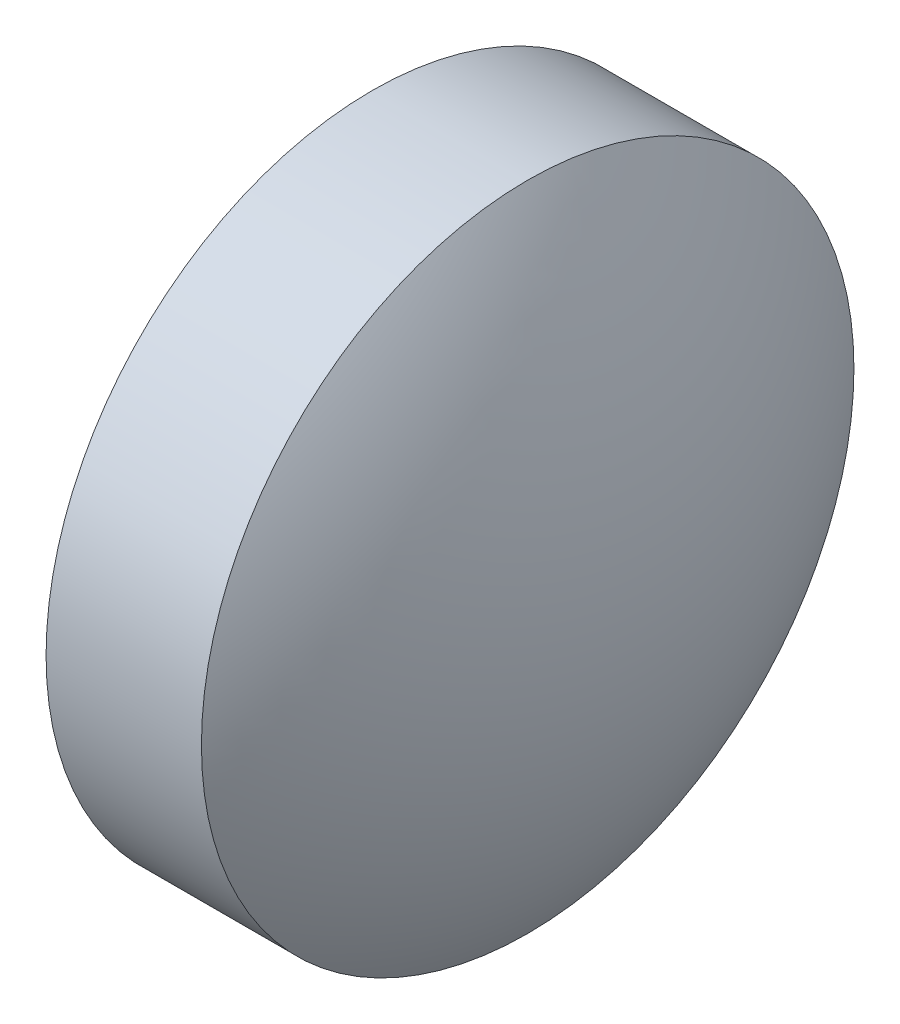
ISO-10303-21;
HEADER;
FILE_DESCRIPTION(('STEP AP214'),'2;1');
FILE_NAME('part.step','',(''),(''),'','','');
FILE_SCHEMA(('AUTOMOTIVE_DESIGN { 1 0 10303 214 1 1 1 1 }'));
ENDSEC;
DATA;
#1=APPLICATION_CONTEXT('core data for automotive mechanical design processes');
#2=APPLICATION_PROTOCOL_DEFINITION('international standard','automotive_design',2000,#1);
#3=PRODUCT_CONTEXT('',#1,'mechanical');
#4=PRODUCT('Part','Part','',(#3));
#5=PRODUCT_RELATED_PRODUCT_CATEGORY('part','',(#4));
#6=PRODUCT_DEFINITION_FORMATION('','',#4);
#7=PRODUCT_DEFINITION_CONTEXT('part definition',#1,'design');
#8=PRODUCT_DEFINITION('design','',#6,#7);
#9=PRODUCT_DEFINITION_SHAPE('','',#8);
#10=(LENGTH_UNIT() NAMED_UNIT(*) SI_UNIT(.MILLI.,.METRE.));
#11=(NAMED_UNIT(*) PLANE_ANGLE_UNIT() SI_UNIT($,.RADIAN.));
#12=(NAMED_UNIT(*) SI_UNIT($,.STERADIAN.) SOLID_ANGLE_UNIT());
#13=UNCERTAINTY_MEASURE_WITH_UNIT(LENGTH_MEASURE(1.E-05),#10,'distance_accuracy_value','');
#14=(GEOMETRIC_REPRESENTATION_CONTEXT(3) GLOBAL_UNCERTAINTY_ASSIGNED_CONTEXT((#13)) GLOBAL_UNIT_ASSIGNED_CONTEXT((#10,
#11,#12)) REPRESENTATION_CONTEXT('',''));
#15=CARTESIAN_POINT('',(0.,0.,0.));
#16=DIRECTION('',(0.,0.,1.));
#17=DIRECTION('',(1.,0.,0.));
#18=AXIS2_PLACEMENT_3D('',#15,#16,#17);
#19=CARTESIAN_POINT('',(414.701911471645,-21.677401606524,0.));
#20=DIRECTION('',(-1.,0.,0.));
#21=DIRECTION('',(0.,1.,0.));
#22=AXIS2_PLACEMENT_3D('',#19,#20,#21);
#23=SPHERICAL_SURFACE('',#22,5.74792553191489);
#24=CARTESIAN_POINT('',(419.50983700356,-21.677401606524,0.));
#25=DIRECTION('',(-1.,0.,0.));
#26=DIRECTION('',(0.,0.,1.));
#27=AXIS2_PLACEMENT_3D('',#24,#25,#26);
#28=CIRCLE('',#27,3.15);
#29=CARTESIAN_POINT('',(419.50983700356,-21.677401606524,3.15));
#30=VERTEX_POINT('',#29);
#31=EDGE_CURVE('E10',#30,#30,#28,.T.);
#32=ORIENTED_EDGE('',*,*,#31,.F.);
#33=EDGE_LOOP('',(#32));
#34=FACE_BOUND('',#33,.T.);
#35=ADVANCED_FACE('F35',(#34),#23,.T.);
#36=CARTESIAN_POINT('',(417.149198914811,-21.677401606524,0.));
#37=DIRECTION('',(-1.,0.,0.));
#38=DIRECTION('',(0.,0.,1.));
#39=AXIS2_PLACEMENT_3D('',#36,#37,#38);
#40=CYLINDRICAL_SURFACE('',#39,3.15);
#41=CARTESIAN_POINT('',(418.00983700356,-21.677401606524,0.));
#42=DIRECTION('',(-1.,0.,0.));
#43=DIRECTION('',(0.,0.,1.));
#44=AXIS2_PLACEMENT_3D('',#41,#42,#43);
#45=CIRCLE('',#44,3.15);
#46=CARTESIAN_POINT('',(418.00983700356,-21.677401606524,3.15));
#47=VERTEX_POINT('',#46);
#48=EDGE_CURVE('E41',#47,#47,#45,.T.);
#49=ORIENTED_EDGE('',*,*,#48,.F.);
#50=EDGE_LOOP('',(#49));
#51=FACE_BOUND('',#50,.T.);
#52=ORIENTED_EDGE('',*,*,#31,.T.);
#53=EDGE_LOOP('',(#52));
#54=FACE_BOUND('',#53,.T.);
#55=ADVANCED_FACE('F49',(#51,#54),#40,.T.);
#56=CARTESIAN_POINT('',(418.00983700356,-21.677401606524,0.));
#57=DIRECTION('',(1.,0.,0.));
#58=DIRECTION('',(0.,0.,-1.));
#59=AXIS2_PLACEMENT_3D('',#56,#57,#58);
#60=PLANE('',#59);
#61=ORIENTED_EDGE('',*,*,#48,.T.);
#62=EDGE_LOOP('',(#61));
#63=FACE_BOUND('',#62,.T.);
#64=ADVANCED_FACE('F47',(#63),#60,.F.);
#65=CLOSED_SHELL('',(#35,#55,#64));
#66=MANIFOLD_SOLID_BREP('B2',#65);
#67=ADVANCED_BREP_SHAPE_REPRESENTATION('',(#18,#66),#14);
#68=SHAPE_DEFINITION_REPRESENTATION(#9,#67);
ENDSEC;
END-ISO-10303-21;
